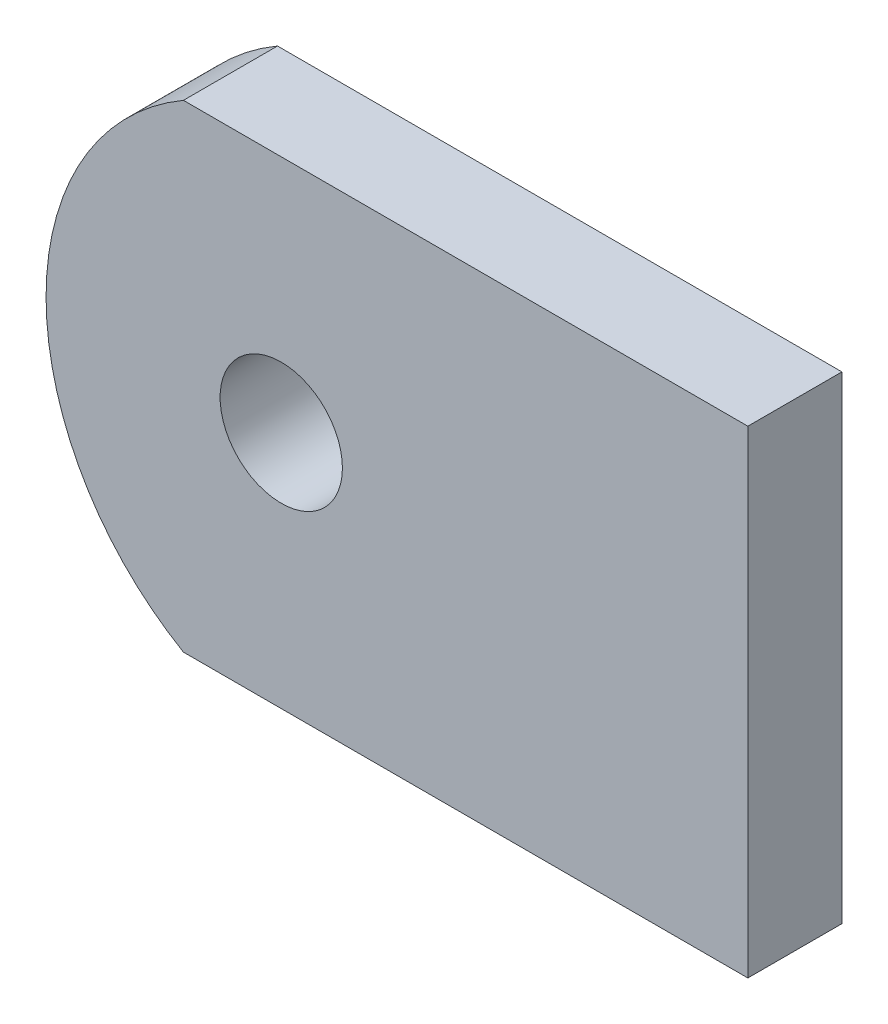
ISO-10303-21;
HEADER;
FILE_DESCRIPTION(('STEP AP214'),'2;1');
FILE_NAME('part.step','',(''),(''),'','','');
FILE_SCHEMA(('AUTOMOTIVE_DESIGN { 1 0 10303 214 1 1 1 1 }'));
ENDSEC;
DATA;
#1=APPLICATION_CONTEXT('core data for automotive mechanical design processes');
#2=APPLICATION_PROTOCOL_DEFINITION('international standard','automotive_design',2000,#1);
#3=PRODUCT_CONTEXT('',#1,'mechanical');
#4=PRODUCT('Part','Part','',(#3));
#5=PRODUCT_RELATED_PRODUCT_CATEGORY('part','',(#4));
#6=PRODUCT_DEFINITION_FORMATION('','',#4);
#7=PRODUCT_DEFINITION_CONTEXT('part definition',#1,'design');
#8=PRODUCT_DEFINITION('design','',#6,#7);
#9=PRODUCT_DEFINITION_SHAPE('','',#8);
#10=(LENGTH_UNIT() NAMED_UNIT(*) SI_UNIT(.MILLI.,.METRE.));
#11=(NAMED_UNIT(*) PLANE_ANGLE_UNIT() SI_UNIT($,.RADIAN.));
#12=(NAMED_UNIT(*) SI_UNIT($,.STERADIAN.) SOLID_ANGLE_UNIT());
#13=UNCERTAINTY_MEASURE_WITH_UNIT(LENGTH_MEASURE(1.E-05),#10,'distance_accuracy_value','');
#14=(GEOMETRIC_REPRESENTATION_CONTEXT(3) GLOBAL_UNCERTAINTY_ASSIGNED_CONTEXT((#13)) GLOBAL_UNIT_ASSIGNED_CONTEXT((#10,
#11,#12)) REPRESENTATION_CONTEXT('',''));
#15=CARTESIAN_POINT('',(0.,0.,0.));
#16=DIRECTION('',(0.,0.,1.));
#17=DIRECTION('',(1.,0.,0.));
#18=AXIS2_PLACEMENT_3D('',#15,#16,#17);
#19=CARTESIAN_POINT('',(-280.069412084101,226.758478509668,5.));
#20=DIRECTION('',(0.,0.,1.));
#21=DIRECTION('',(1.,0.,0.));
#22=AXIS2_PLACEMENT_3D('',#19,#20,#21);
#23=PLANE('',#22);
#24=DIRECTION('',(0.,1.,0.));
#25=VECTOR('',#24,1.);
#26=CARTESIAN_POINT('',(-257.466672358074,239.458478509668,5.));
#27=LINE('',#26,#25);
#28=CARTESIAN_POINT('',(-257.466672358074,214.058478509668,5.));
#29=VERTEX_POINT('',#28);
#30=CARTESIAN_POINT('',(-257.466672358074,239.458478509668,5.));
#31=VERTEX_POINT('',#30);
#32=EDGE_CURVE('E85',#29,#31,#27,.T.);
#33=ORIENTED_EDGE('',*,*,#32,.T.);
#34=DIRECTION('',(-1.,0.,0.));
#35=VECTOR('',#34,1.);
#36=CARTESIAN_POINT('',(-257.466672358074,239.458478509668,5.));
#37=LINE('',#36,#35);
#38=CARTESIAN_POINT('',(-287.466672358074,239.458478509668,5.));
#39=VERTEX_POINT('',#38);
#40=EDGE_CURVE('E80',#31,#39,#37,.T.);
#41=ORIENTED_EDGE('',*,*,#40,.T.);
#42=CARTESIAN_POINT('',(-280.069412084101,226.758478509668,5.));
#43=DIRECTION('',(0.,0.,1.));
#44=DIRECTION('',(1.,0.,0.));
#45=AXIS2_PLACEMENT_3D('',#42,#43,#44);
#46=CIRCLE('',#45,14.6972602739726);
#47=CARTESIAN_POINT('',(-287.466672358074,214.058478509668,5.));
#48=VERTEX_POINT('',#47);
#49=EDGE_CURVE('E83',#39,#48,#46,.T.);
#50=ORIENTED_EDGE('',*,*,#49,.T.);
#51=DIRECTION('',(1.,0.,0.));
#52=VECTOR('',#51,1.);
#53=CARTESIAN_POINT('',(-257.466672358074,214.058478509668,5.));
#54=LINE('',#53,#52);
#55=EDGE_CURVE('E50',#48,#29,#54,.T.);
#56=ORIENTED_EDGE('',*,*,#55,.T.);
#57=EDGE_LOOP('',(#33,#41,#50,#56));
#58=FACE_BOUND('',#57,.T.);
#59=CARTESIAN_POINT('',(-282.266672358074,226.758478509668,5.));
#60=DIRECTION('',(0.,0.,1.));
#61=DIRECTION('',(1.,0.,0.));
#62=AXIS2_PLACEMENT_3D('',#59,#60,#61);
#63=CIRCLE('',#62,3.24999999999995);
#64=CARTESIAN_POINT('',(-279.016672358074,226.758478509668,5.));
#65=VERTEX_POINT('',#64);
#66=EDGE_CURVE('E100',#65,#65,#63,.T.);
#67=ORIENTED_EDGE('',*,*,#66,.F.);
#68=EDGE_LOOP('',(#67));
#69=FACE_BOUND('',#68,.T.);
#70=ADVANCED_FACE('F33',(#58,#69),#23,.T.);
#71=CARTESIAN_POINT('',(-280.069412084101,226.758478509668,0.));
#72=DIRECTION('',(0.,0.,1.));
#73=DIRECTION('',(1.,0.,0.));
#74=AXIS2_PLACEMENT_3D('',#71,#72,#73);
#75=PLANE('',#74);
#76=DIRECTION('',(0.,1.,0.));
#77=VECTOR('',#76,1.);
#78=CARTESIAN_POINT('',(-257.466672358074,239.458478509668,0.));
#79=LINE('',#78,#77);
#80=CARTESIAN_POINT('',(-257.466672358074,214.058478509668,0.));
#81=VERTEX_POINT('',#80);
#82=CARTESIAN_POINT('',(-257.466672358074,239.458478509668,0.));
#83=VERTEX_POINT('',#82);
#84=EDGE_CURVE('E97',#81,#83,#79,.T.);
#85=ORIENTED_EDGE('',*,*,#84,.F.);
#86=DIRECTION('',(1.,0.,0.));
#87=VECTOR('',#86,1.);
#88=CARTESIAN_POINT('',(-257.466672358074,214.058478509668,0.));
#89=LINE('',#88,#87);
#90=CARTESIAN_POINT('',(-287.466672358074,214.058478509668,0.));
#91=VERTEX_POINT('',#90);
#92=EDGE_CURVE('E73',#91,#81,#89,.T.);
#93=ORIENTED_EDGE('',*,*,#92,.F.);
#94=CARTESIAN_POINT('',(-280.069412084101,226.758478509668,0.));
#95=DIRECTION('',(0.,0.,1.));
#96=DIRECTION('',(1.,0.,0.));
#97=AXIS2_PLACEMENT_3D('',#94,#95,#96);
#98=CIRCLE('',#97,14.6972602739726);
#99=CARTESIAN_POINT('',(-287.466672358074,239.458478509668,0.));
#100=VERTEX_POINT('',#99);
#101=EDGE_CURVE('E67',#100,#91,#98,.T.);
#102=ORIENTED_EDGE('',*,*,#101,.F.);
#103=DIRECTION('',(-1.,0.,0.));
#104=VECTOR('',#103,1.);
#105=CARTESIAN_POINT('',(-257.466672358074,239.458478509668,0.));
#106=LINE('',#105,#104);
#107=EDGE_CURVE('E89',#83,#100,#106,.T.);
#108=ORIENTED_EDGE('',*,*,#107,.F.);
#109=EDGE_LOOP('',(#85,#93,#102,#108));
#110=FACE_BOUND('',#109,.T.);
#111=CARTESIAN_POINT('',(-282.266672358074,226.758478509668,0.));
#112=DIRECTION('',(0.,0.,1.));
#113=DIRECTION('',(1.,0.,0.));
#114=AXIS2_PLACEMENT_3D('',#111,#112,#113);
#115=CIRCLE('',#114,3.24999999999995);
#116=CARTESIAN_POINT('',(-279.016672358074,226.758478509668,0.));
#117=VERTEX_POINT('',#116);
#118=EDGE_CURVE('E112',#117,#117,#115,.T.);
#119=ORIENTED_EDGE('',*,*,#118,.T.);
#120=EDGE_LOOP('',(#119));
#121=FACE_BOUND('',#120,.T.);
#122=ADVANCED_FACE('F108',(#110,#121),#75,.F.);
#123=CARTESIAN_POINT('',(-257.466672358074,239.458478509668,5.));
#124=DIRECTION('',(-1.,0.,0.));
#125=DIRECTION('',(0.,0.,1.));
#126=AXIS2_PLACEMENT_3D('',#123,#124,#125);
#127=PLANE('',#126);
#128=ORIENTED_EDGE('',*,*,#84,.T.);
#129=DIRECTION('',(0.,0.,-1.));
#130=VECTOR('',#129,1.);
#131=CARTESIAN_POINT('',(-257.466672358074,239.458478509668,5.));
#132=LINE('',#131,#130);
#133=EDGE_CURVE('E11',#31,#83,#132,.T.);
#134=ORIENTED_EDGE('',*,*,#133,.F.);
#135=ORIENTED_EDGE('',*,*,#32,.F.);
#136=DIRECTION('',(0.,0.,-1.));
#137=VECTOR('',#136,1.);
#138=CARTESIAN_POINT('',(-257.466672358074,214.058478509668,5.));
#139=LINE('',#138,#137);
#140=EDGE_CURVE('E93',#29,#81,#139,.T.);
#141=ORIENTED_EDGE('',*,*,#140,.T.);
#142=EDGE_LOOP('',(#128,#134,#135,#141));
#143=FACE_BOUND('',#142,.T.);
#144=ADVANCED_FACE('F35',(#143),#127,.F.);
#145=CARTESIAN_POINT('',(-257.466672358074,239.458478509668,5.));
#146=DIRECTION('',(0.,-1.,0.));
#147=DIRECTION('',(0.,0.,-1.));
#148=AXIS2_PLACEMENT_3D('',#145,#146,#147);
#149=PLANE('',#148);
#150=ORIENTED_EDGE('',*,*,#107,.T.);
#151=DIRECTION('',(0.,0.,-1.));
#152=VECTOR('',#151,1.);
#153=CARTESIAN_POINT('',(-287.466672358074,239.458478509668,5.));
#154=LINE('',#153,#152);
#155=EDGE_CURVE('E42',#39,#100,#154,.T.);
#156=ORIENTED_EDGE('',*,*,#155,.F.);
#157=ORIENTED_EDGE('',*,*,#40,.F.);
#158=ORIENTED_EDGE('',*,*,#133,.T.);
#159=EDGE_LOOP('',(#150,#156,#157,#158));
#160=FACE_BOUND('',#159,.T.);
#161=ADVANCED_FACE('F88',(#160),#149,.F.);
#162=CARTESIAN_POINT('',(-280.069412084101,226.758478509668,5.));
#163=DIRECTION('',(0.,0.,-1.));
#164=DIRECTION('',(-1.,0.,0.));
#165=AXIS2_PLACEMENT_3D('',#162,#163,#164);
#166=CYLINDRICAL_SURFACE('',#165,14.6972602739726);
#167=ORIENTED_EDGE('',*,*,#101,.T.);
#168=DIRECTION('',(0.,0.,-1.));
#169=VECTOR('',#168,1.);
#170=CARTESIAN_POINT('',(-287.466672358074,214.058478509668,5.));
#171=LINE('',#170,#169);
#172=EDGE_CURVE('E90',#48,#91,#171,.T.);
#173=ORIENTED_EDGE('',*,*,#172,.F.);
#174=ORIENTED_EDGE('',*,*,#49,.F.);
#175=ORIENTED_EDGE('',*,*,#155,.T.);
#176=EDGE_LOOP('',(#167,#173,#174,#175));
#177=FACE_BOUND('',#176,.T.);
#178=ADVANCED_FACE('F91',(#177),#166,.T.);
#179=CARTESIAN_POINT('',(-257.466672358074,214.058478509668,5.));
#180=DIRECTION('',(0.,1.,0.));
#181=DIRECTION('',(-1.,0.,0.));
#182=AXIS2_PLACEMENT_3D('',#179,#180,#181);
#183=PLANE('',#182);
#184=ORIENTED_EDGE('',*,*,#92,.T.);
#185=ORIENTED_EDGE('',*,*,#140,.F.);
#186=ORIENTED_EDGE('',*,*,#55,.F.);
#187=ORIENTED_EDGE('',*,*,#172,.T.);
#188=EDGE_LOOP('',(#184,#185,#186,#187));
#189=FACE_BOUND('',#188,.T.);
#190=ADVANCED_FACE('F105',(#189),#183,.F.);
#191=CARTESIAN_POINT('',(-282.266672358074,226.758478509668,5.));
#192=DIRECTION('',(0.,0.,-1.));
#193=DIRECTION('',(-1.,0.,0.));
#194=AXIS2_PLACEMENT_3D('',#191,#192,#193);
#195=CYLINDRICAL_SURFACE('',#194,3.24999999999995);
#196=ORIENTED_EDGE('',*,*,#66,.T.);
#197=EDGE_LOOP('',(#196));
#198=FACE_BOUND('',#197,.T.);
#199=ORIENTED_EDGE('',*,*,#118,.F.);
#200=EDGE_LOOP('',(#199));
#201=FACE_BOUND('',#200,.T.);
#202=ADVANCED_FACE('F118',(#198,#201),#195,.F.);
#203=CLOSED_SHELL('',(#70,#122,#144,#161,#178,#190,#202));
#204=MANIFOLD_SOLID_BREP('B2',#203);
#205=ADVANCED_BREP_SHAPE_REPRESENTATION('',(#18,#204),#14);
#206=SHAPE_DEFINITION_REPRESENTATION(#9,#205);
ENDSEC;
END-ISO-10303-21;
